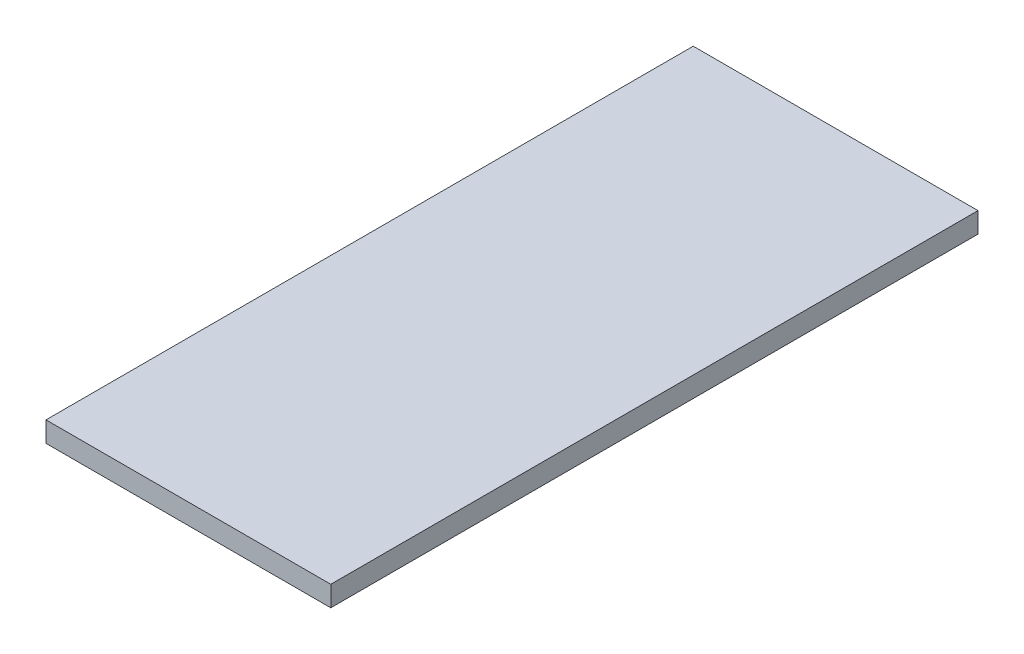
ISO-10303-21;
HEADER;
FILE_DESCRIPTION(('STEP AP214'),'2;1');
FILE_NAME('part.step','',(''),(''),'','','');
FILE_SCHEMA(('AUTOMOTIVE_DESIGN { 1 0 10303 214 1 1 1 1 }'));
ENDSEC;
DATA;
#1=APPLICATION_CONTEXT('core data for automotive mechanical design processes');
#2=APPLICATION_PROTOCOL_DEFINITION('international standard','automotive_design',2000,#1);
#3=PRODUCT_CONTEXT('',#1,'mechanical');
#4=PRODUCT('Part','Part','',(#3));
#5=PRODUCT_RELATED_PRODUCT_CATEGORY('part','',(#4));
#6=PRODUCT_DEFINITION_FORMATION('','',#4);
#7=PRODUCT_DEFINITION_CONTEXT('part definition',#1,'design');
#8=PRODUCT_DEFINITION('design','',#6,#7);
#9=PRODUCT_DEFINITION_SHAPE('','',#8);
#10=(LENGTH_UNIT() NAMED_UNIT(*) SI_UNIT(.MILLI.,.METRE.));
#11=(NAMED_UNIT(*) PLANE_ANGLE_UNIT() SI_UNIT($,.RADIAN.));
#12=(NAMED_UNIT(*) SI_UNIT($,.STERADIAN.) SOLID_ANGLE_UNIT());
#13=UNCERTAINTY_MEASURE_WITH_UNIT(LENGTH_MEASURE(1.E-05),#10,'distance_accuracy_value','');
#14=(GEOMETRIC_REPRESENTATION_CONTEXT(3) GLOBAL_UNCERTAINTY_ASSIGNED_CONTEXT((#13)) GLOBAL_UNIT_ASSIGNED_CONTEXT((#10,
#11,#12)) REPRESENTATION_CONTEXT('',''));
#15=CARTESIAN_POINT('',(0.,0.,0.));
#16=DIRECTION('',(0.,0.,1.));
#17=DIRECTION('',(1.,0.,0.));
#18=AXIS2_PLACEMENT_3D('',#15,#16,#17);
#19=CARTESIAN_POINT('',(11.176,0.8001,25.4));
#20=DIRECTION('',(-1.,0.,0.));
#21=DIRECTION('',(0.,0.,1.));
#22=AXIS2_PLACEMENT_3D('',#19,#20,#21);
#23=PLANE('',#22);
#24=DIRECTION('',(0.,0.,-1.));
#25=VECTOR('',#24,1.);
#26=CARTESIAN_POINT('',(11.176,-0.8001,25.4));
#27=LINE('',#26,#25);
#28=CARTESIAN_POINT('',(11.176,-0.8001,25.4));
#29=VERTEX_POINT('',#28);
#30=CARTESIAN_POINT('',(11.176,-0.8001,-25.4));
#31=VERTEX_POINT('',#30);
#32=EDGE_CURVE('E98',#29,#31,#27,.T.);
#33=ORIENTED_EDGE('',*,*,#32,.T.);
#34=DIRECTION('',(0.,-1.,0.));
#35=VECTOR('',#34,1.);
#36=CARTESIAN_POINT('',(11.176,0.8001,-25.4));
#37=LINE('',#36,#35);
#38=CARTESIAN_POINT('',(11.176,0.8001,-25.4));
#39=VERTEX_POINT('',#38);
#40=EDGE_CURVE('E11',#39,#31,#37,.T.);
#41=ORIENTED_EDGE('',*,*,#40,.F.);
#42=DIRECTION('',(0.,0.,-1.));
#43=VECTOR('',#42,1.);
#44=CARTESIAN_POINT('',(11.176,0.8001,25.4));
#45=LINE('',#44,#43);
#46=CARTESIAN_POINT('',(11.176,0.8001,25.4));
#47=VERTEX_POINT('',#46);
#48=EDGE_CURVE('E86',#47,#39,#45,.T.);
#49=ORIENTED_EDGE('',*,*,#48,.F.);
#50=DIRECTION('',(0.,-1.,0.));
#51=VECTOR('',#50,1.);
#52=CARTESIAN_POINT('',(11.176,0.8001,25.4));
#53=LINE('',#52,#51);
#54=EDGE_CURVE('E94',#47,#29,#53,.T.);
#55=ORIENTED_EDGE('',*,*,#54,.T.);
#56=EDGE_LOOP('',(#33,#41,#49,#55));
#57=FACE_BOUND('',#56,.T.);
#58=ADVANCED_FACE('F35',(#57),#23,.F.);
#59=CARTESIAN_POINT('',(-11.176,0.8001,-25.4));
#60=DIRECTION('',(0.,0.,1.));
#61=DIRECTION('',(1.,0.,0.));
#62=AXIS2_PLACEMENT_3D('',#59,#60,#61);
#63=PLANE('',#62);
#64=DIRECTION('',(-1.,0.,0.));
#65=VECTOR('',#64,1.);
#66=CARTESIAN_POINT('',(-11.176,-0.8001,-25.4));
#67=LINE('',#66,#65);
#68=CARTESIAN_POINT('',(-11.176,-0.8001,-25.4));
#69=VERTEX_POINT('',#68);
#70=EDGE_CURVE('E90',#31,#69,#67,.T.);
#71=ORIENTED_EDGE('',*,*,#70,.T.);
#72=DIRECTION('',(0.,-1.,0.));
#73=VECTOR('',#72,1.);
#74=CARTESIAN_POINT('',(-11.176,0.8001,-25.4));
#75=LINE('',#74,#73);
#76=CARTESIAN_POINT('',(-11.176,0.8001,-25.4));
#77=VERTEX_POINT('',#76);
#78=EDGE_CURVE('E43',#77,#69,#75,.T.);
#79=ORIENTED_EDGE('',*,*,#78,.F.);
#80=DIRECTION('',(-1.,0.,0.));
#81=VECTOR('',#80,1.);
#82=CARTESIAN_POINT('',(-11.176,0.8001,-25.4));
#83=LINE('',#82,#81);
#84=EDGE_CURVE('E81',#39,#77,#83,.T.);
#85=ORIENTED_EDGE('',*,*,#84,.F.);
#86=ORIENTED_EDGE('',*,*,#40,.T.);
#87=EDGE_LOOP('',(#71,#79,#85,#86));
#88=FACE_BOUND('',#87,.T.);
#89=ADVANCED_FACE('F89',(#88),#63,.F.);
#90=CARTESIAN_POINT('',(-11.176,0.8001,25.4));
#91=DIRECTION('',(1.,0.,0.));
#92=DIRECTION('',(0.,0.,-1.));
#93=AXIS2_PLACEMENT_3D('',#90,#91,#92);
#94=PLANE('',#93);
#95=DIRECTION('',(0.,0.,1.));
#96=VECTOR('',#95,1.);
#97=CARTESIAN_POINT('',(-11.176,-0.8001,25.4));
#98=LINE('',#97,#96);
#99=CARTESIAN_POINT('',(-11.176,-0.8001,25.4));
#100=VERTEX_POINT('',#99);
#101=EDGE_CURVE('E68',#69,#100,#98,.T.);
#102=ORIENTED_EDGE('',*,*,#101,.T.);
#103=DIRECTION('',(0.,-1.,0.));
#104=VECTOR('',#103,1.);
#105=CARTESIAN_POINT('',(-11.176,0.8001,25.4));
#106=LINE('',#105,#104);
#107=CARTESIAN_POINT('',(-11.176,0.8001,25.4));
#108=VERTEX_POINT('',#107);
#109=EDGE_CURVE('E91',#108,#100,#106,.T.);
#110=ORIENTED_EDGE('',*,*,#109,.F.);
#111=DIRECTION('',(0.,0.,1.));
#112=VECTOR('',#111,1.);
#113=CARTESIAN_POINT('',(-11.176,0.8001,25.4));
#114=LINE('',#113,#112);
#115=EDGE_CURVE('E84',#77,#108,#114,.T.);
#116=ORIENTED_EDGE('',*,*,#115,.F.);
#117=ORIENTED_EDGE('',*,*,#78,.T.);
#118=EDGE_LOOP('',(#102,#110,#116,#117));
#119=FACE_BOUND('',#118,.T.);
#120=ADVANCED_FACE('F92',(#119),#94,.F.);
#121=CARTESIAN_POINT('',(-11.176,0.8001,25.4));
#122=DIRECTION('',(0.,0.,-1.));
#123=DIRECTION('',(-1.,0.,0.));
#124=AXIS2_PLACEMENT_3D('',#121,#122,#123);
#125=PLANE('',#124);
#126=DIRECTION('',(1.,0.,0.));
#127=VECTOR('',#126,1.);
#128=CARTESIAN_POINT('',(-11.176,-0.8001,25.4));
#129=LINE('',#128,#127);
#130=EDGE_CURVE('E74',#100,#29,#129,.T.);
#131=ORIENTED_EDGE('',*,*,#130,.T.);
#132=ORIENTED_EDGE('',*,*,#54,.F.);
#133=DIRECTION('',(1.,0.,0.));
#134=VECTOR('',#133,1.);
#135=CARTESIAN_POINT('',(-11.176,0.8001,25.4));
#136=LINE('',#135,#134);
#137=EDGE_CURVE('E51',#108,#47,#136,.T.);
#138=ORIENTED_EDGE('',*,*,#137,.F.);
#139=ORIENTED_EDGE('',*,*,#109,.T.);
#140=EDGE_LOOP('',(#131,#132,#138,#139));
#141=FACE_BOUND('',#140,.T.);
#142=ADVANCED_FACE('F105',(#141),#125,.F.);
#143=CARTESIAN_POINT('',(0.,0.8001,0.));
#144=DIRECTION('',(0.,-1.,0.));
#145=DIRECTION('',(0.,0.,-1.));
#146=AXIS2_PLACEMENT_3D('',#143,#144,#145);
#147=PLANE('',#146);
#148=ORIENTED_EDGE('',*,*,#48,.T.);
#149=ORIENTED_EDGE('',*,*,#84,.T.);
#150=ORIENTED_EDGE('',*,*,#115,.T.);
#151=ORIENTED_EDGE('',*,*,#137,.T.);
#152=EDGE_LOOP('',(#148,#149,#150,#151));
#153=FACE_BOUND('',#152,.T.);
#154=ADVANCED_FACE('F82',(#153),#147,.F.);
#155=CARTESIAN_POINT('',(0.,-0.8001,0.));
#156=DIRECTION('',(0.,-1.,0.));
#157=DIRECTION('',(0.,0.,-1.));
#158=AXIS2_PLACEMENT_3D('',#155,#156,#157);
#159=PLANE('',#158);
#160=ORIENTED_EDGE('',*,*,#32,.F.);
#161=ORIENTED_EDGE('',*,*,#130,.F.);
#162=ORIENTED_EDGE('',*,*,#101,.F.);
#163=ORIENTED_EDGE('',*,*,#70,.F.);
#164=EDGE_LOOP('',(#160,#161,#162,#163));
#165=FACE_BOUND('',#164,.T.);
#166=ADVANCED_FACE('F108',(#165),#159,.T.);
#167=CLOSED_SHELL('',(#58,#89,#120,#142,#154,#166));
#168=MANIFOLD_SOLID_BREP('B2',#167);
#169=ADVANCED_BREP_SHAPE_REPRESENTATION('',(#18,#168),#14);
#170=SHAPE_DEFINITION_REPRESENTATION(#9,#169);
ENDSEC;
END-ISO-10303-21;
